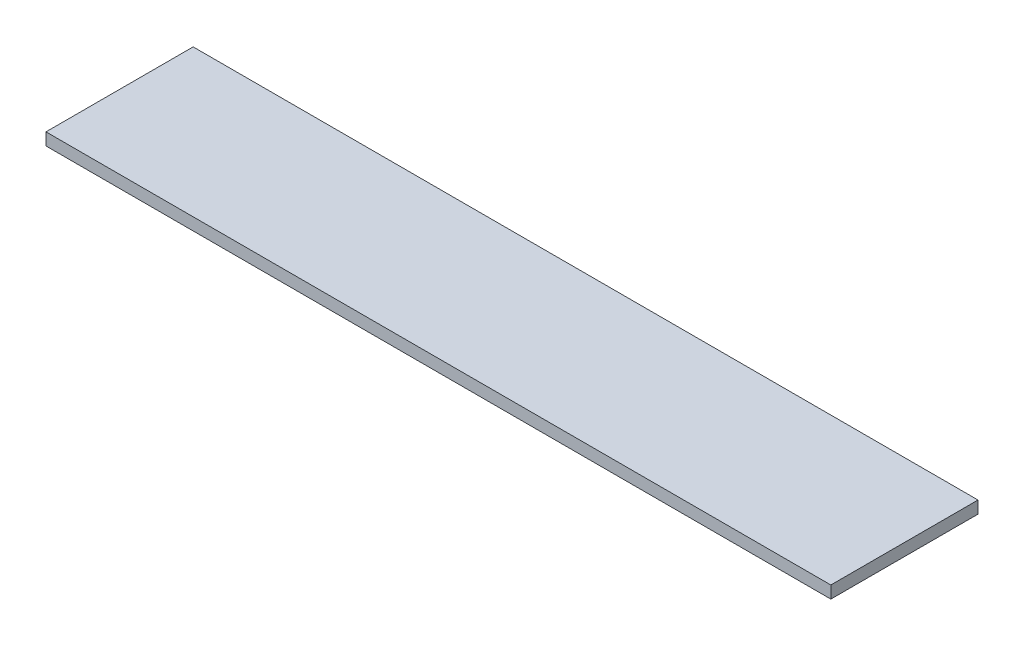
ISO-10303-21;
HEADER;
FILE_DESCRIPTION(('STEP AP214'),'2;1');
FILE_NAME('part.step','',(''),(''),'','','');
FILE_SCHEMA(('AUTOMOTIVE_DESIGN { 1 0 10303 214 1 1 1 1 }'));
ENDSEC;
DATA;
#1=APPLICATION_CONTEXT('core data for automotive mechanical design processes');
#2=APPLICATION_PROTOCOL_DEFINITION('international standard','automotive_design',2000,#1);
#3=PRODUCT_CONTEXT('',#1,'mechanical');
#4=PRODUCT('Part','Part','',(#3));
#5=PRODUCT_RELATED_PRODUCT_CATEGORY('part','',(#4));
#6=PRODUCT_DEFINITION_FORMATION('','',#4);
#7=PRODUCT_DEFINITION_CONTEXT('part definition',#1,'design');
#8=PRODUCT_DEFINITION('design','',#6,#7);
#9=PRODUCT_DEFINITION_SHAPE('','',#8);
#10=(LENGTH_UNIT() NAMED_UNIT(*) SI_UNIT(.MILLI.,.METRE.));
#11=(NAMED_UNIT(*) PLANE_ANGLE_UNIT() SI_UNIT($,.RADIAN.));
#12=(NAMED_UNIT(*) SI_UNIT($,.STERADIAN.) SOLID_ANGLE_UNIT());
#13=UNCERTAINTY_MEASURE_WITH_UNIT(LENGTH_MEASURE(1.E-05),#10,'distance_accuracy_value','');
#14=(GEOMETRIC_REPRESENTATION_CONTEXT(3) GLOBAL_UNCERTAINTY_ASSIGNED_CONTEXT((#13)) GLOBAL_UNIT_ASSIGNED_CONTEXT((#10,
#11,#12)) REPRESENTATION_CONTEXT('',''));
#15=CARTESIAN_POINT('',(0.,0.,0.));
#16=DIRECTION('',(0.,0.,1.));
#17=DIRECTION('',(1.,0.,0.));
#18=AXIS2_PLACEMENT_3D('',#15,#16,#17);
#19=CARTESIAN_POINT('',(0.,6.35,0.));
#20=DIRECTION('',(1.,0.,0.));
#21=DIRECTION('',(0.,0.,-1.));
#22=AXIS2_PLACEMENT_3D('',#19,#20,#21);
#23=PLANE('',#22);
#24=DIRECTION('',(0.,0.,1.));
#25=VECTOR('',#24,1.);
#26=CARTESIAN_POINT('',(0.,0.,0.));
#27=LINE('',#26,#25);
#28=CARTESIAN_POINT('',(0.,0.,-76.2));
#29=VERTEX_POINT('',#28);
#30=CARTESIAN_POINT('',(0.,0.,0.));
#31=VERTEX_POINT('',#30);
#32=EDGE_CURVE('E97',#29,#31,#27,.T.);
#33=ORIENTED_EDGE('',*,*,#32,.T.);
#34=DIRECTION('',(0.,-1.,0.));
#35=VECTOR('',#34,1.);
#36=CARTESIAN_POINT('',(0.,6.35,0.));
#37=LINE('',#36,#35);
#38=CARTESIAN_POINT('',(0.,6.35,0.));
#39=VERTEX_POINT('',#38);
#40=EDGE_CURVE('E11',#39,#31,#37,.T.);
#41=ORIENTED_EDGE('',*,*,#40,.F.);
#42=DIRECTION('',(0.,0.,1.));
#43=VECTOR('',#42,1.);
#44=CARTESIAN_POINT('',(0.,6.35,0.));
#45=LINE('',#44,#43);
#46=CARTESIAN_POINT('',(0.,6.35,-76.2));
#47=VERTEX_POINT('',#46);
#48=EDGE_CURVE('E85',#47,#39,#45,.T.);
#49=ORIENTED_EDGE('',*,*,#48,.F.);
#50=DIRECTION('',(0.,-1.,0.));
#51=VECTOR('',#50,1.);
#52=CARTESIAN_POINT('',(0.,6.35,-76.2));
#53=LINE('',#52,#51);
#54=EDGE_CURVE('E93',#47,#29,#53,.T.);
#55=ORIENTED_EDGE('',*,*,#54,.T.);
#56=EDGE_LOOP('',(#33,#41,#49,#55));
#57=FACE_BOUND('',#56,.T.);
#58=ADVANCED_FACE('F34',(#57),#23,.F.);
#59=CARTESIAN_POINT('',(0.,6.35,0.));
#60=DIRECTION('',(0.,0.,-1.));
#61=DIRECTION('',(-1.,0.,0.));
#62=AXIS2_PLACEMENT_3D('',#59,#60,#61);
#63=PLANE('',#62);
#64=DIRECTION('',(1.,0.,0.));
#65=VECTOR('',#64,1.);
#66=CARTESIAN_POINT('',(0.,0.,0.));
#67=LINE('',#66,#65);
#68=CARTESIAN_POINT('',(406.4,0.,0.));
#69=VERTEX_POINT('',#68);
#70=EDGE_CURVE('E89',#31,#69,#67,.T.);
#71=ORIENTED_EDGE('',*,*,#70,.T.);
#72=DIRECTION('',(0.,-1.,0.));
#73=VECTOR('',#72,1.);
#74=CARTESIAN_POINT('',(406.4,6.35,0.));
#75=LINE('',#74,#73);
#76=CARTESIAN_POINT('',(406.4,6.35,0.));
#77=VERTEX_POINT('',#76);
#78=EDGE_CURVE('E42',#77,#69,#75,.T.);
#79=ORIENTED_EDGE('',*,*,#78,.F.);
#80=DIRECTION('',(1.,0.,0.));
#81=VECTOR('',#80,1.);
#82=CARTESIAN_POINT('',(0.,6.35,0.));
#83=LINE('',#82,#81);
#84=EDGE_CURVE('E80',#39,#77,#83,.T.);
#85=ORIENTED_EDGE('',*,*,#84,.F.);
#86=ORIENTED_EDGE('',*,*,#40,.T.);
#87=EDGE_LOOP('',(#71,#79,#85,#86));
#88=FACE_BOUND('',#87,.T.);
#89=ADVANCED_FACE('F88',(#88),#63,.F.);
#90=CARTESIAN_POINT('',(406.4,6.35,0.));
#91=DIRECTION('',(-1.,0.,0.));
#92=DIRECTION('',(0.,0.,1.));
#93=AXIS2_PLACEMENT_3D('',#90,#91,#92);
#94=PLANE('',#93);
#95=DIRECTION('',(0.,0.,-1.));
#96=VECTOR('',#95,1.);
#97=CARTESIAN_POINT('',(406.4,0.,0.));
#98=LINE('',#97,#96);
#99=CARTESIAN_POINT('',(406.4,0.,-76.2));
#100=VERTEX_POINT('',#99);
#101=EDGE_CURVE('E67',#69,#100,#98,.T.);
#102=ORIENTED_EDGE('',*,*,#101,.T.);
#103=DIRECTION('',(0.,-1.,0.));
#104=VECTOR('',#103,1.);
#105=CARTESIAN_POINT('',(406.4,6.35,-76.2));
#106=LINE('',#105,#104);
#107=CARTESIAN_POINT('',(406.4,6.35,-76.2));
#108=VERTEX_POINT('',#107);
#109=EDGE_CURVE('E90',#108,#100,#106,.T.);
#110=ORIENTED_EDGE('',*,*,#109,.F.);
#111=DIRECTION('',(0.,0.,-1.));
#112=VECTOR('',#111,1.);
#113=CARTESIAN_POINT('',(406.4,6.35,0.));
#114=LINE('',#113,#112);
#115=EDGE_CURVE('E83',#77,#108,#114,.T.);
#116=ORIENTED_EDGE('',*,*,#115,.F.);
#117=ORIENTED_EDGE('',*,*,#78,.T.);
#118=EDGE_LOOP('',(#102,#110,#116,#117));
#119=FACE_BOUND('',#118,.T.);
#120=ADVANCED_FACE('F91',(#119),#94,.F.);
#121=CARTESIAN_POINT('',(0.,6.35,-76.2));
#122=DIRECTION('',(0.,0.,1.));
#123=DIRECTION('',(1.,0.,0.));
#124=AXIS2_PLACEMENT_3D('',#121,#122,#123);
#125=PLANE('',#124);
#126=DIRECTION('',(-1.,0.,0.));
#127=VECTOR('',#126,1.);
#128=CARTESIAN_POINT('',(0.,0.,-76.2));
#129=LINE('',#128,#127);
#130=EDGE_CURVE('E73',#100,#29,#129,.T.);
#131=ORIENTED_EDGE('',*,*,#130,.T.);
#132=ORIENTED_EDGE('',*,*,#54,.F.);
#133=DIRECTION('',(-1.,0.,0.));
#134=VECTOR('',#133,1.);
#135=CARTESIAN_POINT('',(0.,6.35,-76.2));
#136=LINE('',#135,#134);
#137=EDGE_CURVE('E50',#108,#47,#136,.T.);
#138=ORIENTED_EDGE('',*,*,#137,.F.);
#139=ORIENTED_EDGE('',*,*,#109,.T.);
#140=EDGE_LOOP('',(#131,#132,#138,#139));
#141=FACE_BOUND('',#140,.T.);
#142=ADVANCED_FACE('F104',(#141),#125,.F.);
#143=CARTESIAN_POINT('',(0.,6.35,0.));
#144=DIRECTION('',(0.,-1.,0.));
#145=DIRECTION('',(0.,0.,-1.));
#146=AXIS2_PLACEMENT_3D('',#143,#144,#145);
#147=PLANE('',#146);
#148=ORIENTED_EDGE('',*,*,#48,.T.);
#149=ORIENTED_EDGE('',*,*,#84,.T.);
#150=ORIENTED_EDGE('',*,*,#115,.T.);
#151=ORIENTED_EDGE('',*,*,#137,.T.);
#152=EDGE_LOOP('',(#148,#149,#150,#151));
#153=FACE_BOUND('',#152,.T.);
#154=ADVANCED_FACE('F81',(#153),#147,.F.);
#155=CARTESIAN_POINT('',(0.,0.,0.));
#156=DIRECTION('',(0.,-1.,0.));
#157=DIRECTION('',(0.,0.,-1.));
#158=AXIS2_PLACEMENT_3D('',#155,#156,#157);
#159=PLANE('',#158);
#160=ORIENTED_EDGE('',*,*,#32,.F.);
#161=ORIENTED_EDGE('',*,*,#130,.F.);
#162=ORIENTED_EDGE('',*,*,#101,.F.);
#163=ORIENTED_EDGE('',*,*,#70,.F.);
#164=EDGE_LOOP('',(#160,#161,#162,#163));
#165=FACE_BOUND('',#164,.T.);
#166=ADVANCED_FACE('F107',(#165),#159,.T.);
#167=CLOSED_SHELL('',(#58,#89,#120,#142,#154,#166));
#168=MANIFOLD_SOLID_BREP('B2',#167);
#169=ADVANCED_BREP_SHAPE_REPRESENTATION('',(#18,#168),#14);
#170=SHAPE_DEFINITION_REPRESENTATION(#9,#169);
ENDSEC;
END-ISO-10303-21;
